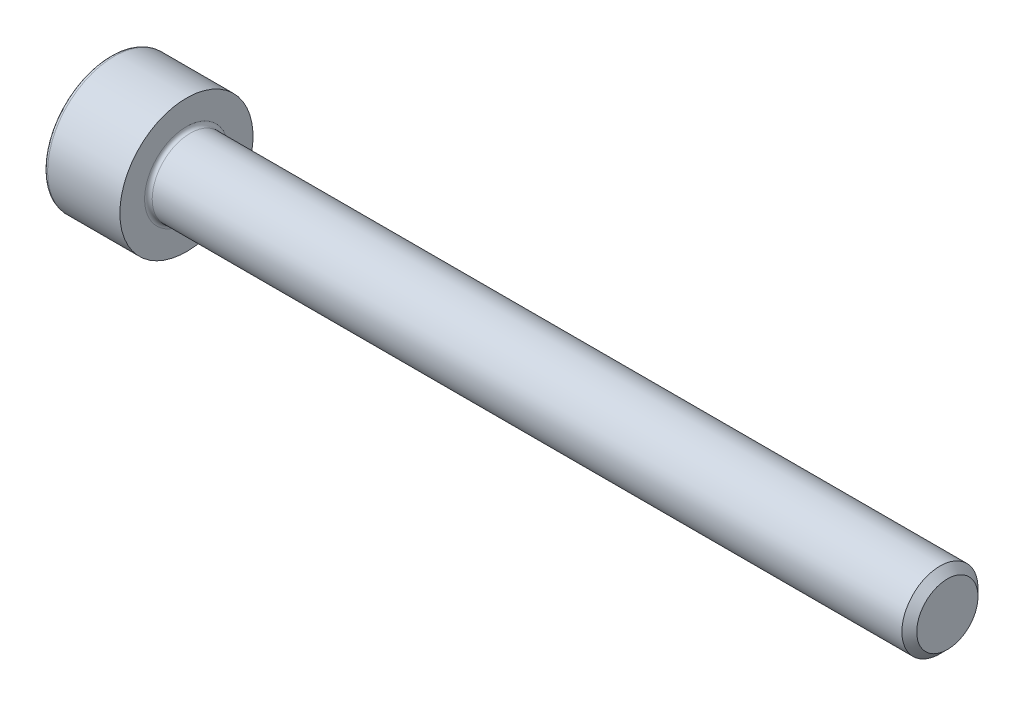
ISO-10303-21;
HEADER;
FILE_DESCRIPTION(('STEP AP214'),'2;1');
FILE_NAME('part.step','',(''),(''),'','','');
FILE_SCHEMA(('AUTOMOTIVE_DESIGN { 1 0 10303 214 1 1 1 1 }'));
ENDSEC;
DATA;
#1=APPLICATION_CONTEXT('core data for automotive mechanical design processes');
#2=APPLICATION_PROTOCOL_DEFINITION('international standard','automotive_design',2000,#1);
#3=PRODUCT_CONTEXT('',#1,'mechanical');
#4=PRODUCT('Part','Part','',(#3));
#5=PRODUCT_RELATED_PRODUCT_CATEGORY('part','',(#4));
#6=PRODUCT_DEFINITION_FORMATION('','',#4);
#7=PRODUCT_DEFINITION_CONTEXT('part definition',#1,'design');
#8=PRODUCT_DEFINITION('design','',#6,#7);
#9=PRODUCT_DEFINITION_SHAPE('','',#8);
#10=(LENGTH_UNIT() NAMED_UNIT(*) SI_UNIT(.MILLI.,.METRE.));
#11=(NAMED_UNIT(*) PLANE_ANGLE_UNIT() SI_UNIT($,.RADIAN.));
#12=(NAMED_UNIT(*) SI_UNIT($,.STERADIAN.) SOLID_ANGLE_UNIT());
#13=UNCERTAINTY_MEASURE_WITH_UNIT(LENGTH_MEASURE(1.E-05),#10,'distance_accuracy_value','');
#14=(GEOMETRIC_REPRESENTATION_CONTEXT(3) GLOBAL_UNCERTAINTY_ASSIGNED_CONTEXT((#13)) GLOBAL_UNIT_ASSIGNED_CONTEXT((#10,
#11,#12)) REPRESENTATION_CONTEXT('',''));
#15=CARTESIAN_POINT('',(0.,0.,0.));
#16=DIRECTION('',(0.,0.,1.));
#17=DIRECTION('',(1.,0.,0.));
#18=AXIS2_PLACEMENT_3D('',#15,#16,#17);
#19=CARTESIAN_POINT('',(0.,0.,0.));
#20=DIRECTION('',(-1.,0.,0.));
#21=DIRECTION('',(0.,0.,1.));
#22=AXIS2_PLACEMENT_3D('',#19,#20,#21);
#23=PLANE('',#22);
#24=DIRECTION('',(0.,-0.499999999999999,0.866025403784439));
#25=VECTOR('',#24,1.);
#26=CARTESIAN_POINT('',(0.,1.77304267668134,0.));
#27=LINE('',#26,#25);
#28=CARTESIAN_POINT('',(0.,1.77304267668134,0.));
#29=VERTEX_POINT('',#28);
#30=CARTESIAN_POINT('',(0.,0.886521338340669,1.5355));
#31=VERTEX_POINT('',#30);
#32=EDGE_CURVE('E265',#29,#31,#27,.T.);
#33=ORIENTED_EDGE('',*,*,#32,.T.);
#34=DIRECTION('',(0.,1.,0.));
#35=VECTOR('',#34,1.);
#36=CARTESIAN_POINT('',(0.,-0.886521338340671,1.5355));
#37=LINE('',#36,#35);
#38=CARTESIAN_POINT('',(0.,-0.886521338340671,1.5355));
#39=VERTEX_POINT('',#38);
#40=EDGE_CURVE('E126',#39,#31,#37,.T.);
#41=ORIENTED_EDGE('',*,*,#40,.F.);
#42=DIRECTION('',(0.,-0.500000000000001,-0.866025403784438));
#43=VECTOR('',#42,1.);
#44=CARTESIAN_POINT('',(0.,-0.886521338340671,1.5355));
#45=LINE('',#44,#43);
#46=CARTESIAN_POINT('',(0.,-1.77304267668134,0.));
#47=VERTEX_POINT('',#46);
#48=EDGE_CURVE('E268',#39,#47,#45,.T.);
#49=ORIENTED_EDGE('',*,*,#48,.T.);
#50=DIRECTION('',(0.,0.499999999999999,-0.866025403784439));
#51=VECTOR('',#50,1.);
#52=CARTESIAN_POINT('',(0.,-1.77304267668134,0.));
#53=LINE('',#52,#51);
#54=CARTESIAN_POINT('',(0.,-0.886521338340675,-1.5355));
#55=VERTEX_POINT('',#54);
#56=EDGE_CURVE('E271',#47,#55,#53,.T.);
#57=ORIENTED_EDGE('',*,*,#56,.T.);
#58=DIRECTION('',(0.,-1.,0.));
#59=VECTOR('',#58,1.);
#60=CARTESIAN_POINT('',(0.,0.886521338340665,-1.5355));
#61=LINE('',#60,#59);
#62=CARTESIAN_POINT('',(0.,0.886521338340665,-1.5355));
#63=VERTEX_POINT('',#62);
#64=EDGE_CURVE('E274',#63,#55,#61,.T.);
#65=ORIENTED_EDGE('',*,*,#64,.F.);
#66=DIRECTION('',(0.,-0.500000000000001,-0.866025403784438));
#67=VECTOR('',#66,1.);
#68=CARTESIAN_POINT('',(0.,1.77304267668134,0.));
#69=LINE('',#68,#67);
#70=EDGE_CURVE('E121',#29,#63,#69,.T.);
#71=ORIENTED_EDGE('',*,*,#70,.F.);
#72=EDGE_LOOP('',(#33,#41,#49,#57,#65,#71));
#73=FACE_BOUND('',#72,.T.);
#74=CARTESIAN_POINT('',(0.,0.,0.));
#75=DIRECTION('',(-1.,0.,0.));
#76=DIRECTION('',(0.,0.,1.));
#77=AXIS2_PLACEMENT_3D('',#74,#75,#76);
#78=CIRCLE('',#77,3.3);
#79=CARTESIAN_POINT('',(0.,0.,3.3));
#80=VERTEX_POINT('',#79);
#81=EDGE_CURVE('E42',#80,#80,#78,.T.);
#82=ORIENTED_EDGE('',*,*,#81,.T.);
#83=EDGE_LOOP('',(#82));
#84=FACE_BOUND('',#83,.T.);
#85=ADVANCED_FACE('F34',(#73,#84),#23,.T.);
#86=CARTESIAN_POINT('',(-31.75,0.,0.));
#87=DIRECTION('',(-1.,0.,0.));
#88=DIRECTION('',(0.,0.,1.));
#89=AXIS2_PLACEMENT_3D('',#86,#87,#88);
#90=CYLINDRICAL_SURFACE('',#89,3.5);
#91=CARTESIAN_POINT('',(0.199999999999999,0.,0.));
#92=DIRECTION('',(-1.,0.,0.));
#93=DIRECTION('',(0.,0.,1.));
#94=AXIS2_PLACEMENT_3D('',#91,#92,#93);
#95=CIRCLE('',#94,3.5);
#96=CARTESIAN_POINT('',(0.199999999999999,0.,3.5));
#97=VERTEX_POINT('',#96);
#98=EDGE_CURVE('E11',#97,#97,#95,.F.);
#99=ORIENTED_EDGE('',*,*,#98,.T.);
#100=EDGE_LOOP('',(#99));
#101=FACE_BOUND('',#100,.T.);
#102=CARTESIAN_POINT('',(4.,0.,0.));
#103=DIRECTION('',(-1.,0.,0.));
#104=DIRECTION('',(0.,0.,1.));
#105=AXIS2_PLACEMENT_3D('',#102,#103,#104);
#106=CIRCLE('',#105,3.5);
#107=CARTESIAN_POINT('',(4.,0.,3.5));
#108=VERTEX_POINT('',#107);
#109=EDGE_CURVE('E144',#108,#108,#106,.T.);
#110=ORIENTED_EDGE('',*,*,#109,.T.);
#111=EDGE_LOOP('',(#110));
#112=FACE_BOUND('',#111,.T.);
#113=ADVANCED_FACE('F168',(#101,#112),#90,.T.);
#114=CARTESIAN_POINT('',(4.00000000000001,3.5,0.));
#115=DIRECTION('',(1.,0.,0.));
#116=DIRECTION('',(0.,0.,-1.));
#117=AXIS2_PLACEMENT_3D('',#114,#115,#116);
#118=PLANE('',#117);
#119=CARTESIAN_POINT('',(4.00000000000001,0.,0.));
#120=DIRECTION('',(1.,0.,0.));
#121=DIRECTION('',(0.,0.,-1.));
#122=AXIS2_PLACEMENT_3D('',#119,#120,#121);
#123=CIRCLE('',#122,2.19999999999998);
#124=CARTESIAN_POINT('',(4.00000000000001,0.,-2.19999999999998));
#125=VERTEX_POINT('',#124);
#126=EDGE_CURVE('E147',#125,#125,#123,.F.);
#127=ORIENTED_EDGE('',*,*,#126,.T.);
#128=EDGE_LOOP('',(#127));
#129=FACE_BOUND('',#128,.T.);
#130=ORIENTED_EDGE('',*,*,#109,.F.);
#131=EDGE_LOOP('',(#130));
#132=FACE_BOUND('',#131,.T.);
#133=ADVANCED_FACE('F174',(#129,#132),#118,.T.);
#134=CARTESIAN_POINT('',(-31.75,0.,0.));
#135=DIRECTION('',(-1.,0.,0.));
#136=DIRECTION('',(0.,0.,1.));
#137=AXIS2_PLACEMENT_3D('',#134,#135,#136);
#138=CYLINDRICAL_SURFACE('',#137,1.99999999999998);
#139=CARTESIAN_POINT('',(4.20000000000001,0.,0.));
#140=DIRECTION('',(1.,0.,0.));
#141=DIRECTION('',(0.,0.,-1.));
#142=AXIS2_PLACEMENT_3D('',#139,#140,#141);
#143=CIRCLE('',#142,1.99999999999998);
#144=CARTESIAN_POINT('',(4.20000000000001,0.,-1.99999999999998));
#145=VERTEX_POINT('',#144);
#146=EDGE_CURVE('E150',#145,#145,#143,.T.);
#147=ORIENTED_EDGE('',*,*,#146,.T.);
#148=EDGE_LOOP('',(#147));
#149=FACE_BOUND('',#148,.T.);
#150=CARTESIAN_POINT('',(43.61,0.,0.));
#151=DIRECTION('',(-1.,0.,0.));
#152=DIRECTION('',(0.,0.,1.));
#153=AXIS2_PLACEMENT_3D('',#150,#151,#152);
#154=CIRCLE('',#153,1.99999999999995);
#155=CARTESIAN_POINT('',(43.61,0.,1.99999999999995));
#156=VERTEX_POINT('',#155);
#157=EDGE_CURVE('E141',#156,#156,#154,.T.);
#158=ORIENTED_EDGE('',*,*,#157,.T.);
#159=EDGE_LOOP('',(#158));
#160=FACE_BOUND('',#159,.T.);
#161=ADVANCED_FACE('F180',(#149,#160),#138,.T.);
#162=CARTESIAN_POINT('',(44.,0.,0.));
#163=DIRECTION('',(-1.,0.,0.));
#164=DIRECTION('',(0.,0.,1.));
#165=AXIS2_PLACEMENT_3D('',#162,#163,#164);
#166=CONICAL_SURFACE('',#165,1.61,0.785398163397327);
#167=ORIENTED_EDGE('',*,*,#157,.F.);
#168=EDGE_LOOP('',(#167));
#169=FACE_BOUND('',#168,.T.);
#170=CARTESIAN_POINT('',(44.,0.,0.));
#171=DIRECTION('',(-1.,0.,0.));
#172=DIRECTION('',(0.,0.,1.));
#173=AXIS2_PLACEMENT_3D('',#170,#171,#172);
#174=CIRCLE('',#173,1.61);
#175=CARTESIAN_POINT('',(44.,0.,1.61));
#176=VERTEX_POINT('',#175);
#177=EDGE_CURVE('E137',#176,#176,#174,.T.);
#178=ORIENTED_EDGE('',*,*,#177,.T.);
#179=EDGE_LOOP('',(#178));
#180=FACE_BOUND('',#179,.T.);
#181=ADVANCED_FACE('F184',(#169,#180),#166,.T.);
#182=CARTESIAN_POINT('',(44.,1.61,0.));
#183=DIRECTION('',(1.,0.,0.));
#184=DIRECTION('',(0.,0.,-1.));
#185=AXIS2_PLACEMENT_3D('',#182,#183,#184);
#186=PLANE('',#185);
#187=ORIENTED_EDGE('',*,*,#177,.F.);
#188=EDGE_LOOP('',(#187));
#189=FACE_BOUND('',#188,.T.);
#190=ADVANCED_FACE('F164',(#189),#186,.T.);
#191=CARTESIAN_POINT('',(4.20000000000001,0.,0.));
#192=DIRECTION('',(1.,0.,0.));
#193=DIRECTION('',(0.,0.,-1.));
#194=AXIS2_PLACEMENT_3D('',#191,#192,#193);
#195=TOROIDAL_SURFACE('',#194,2.19999999999998,0.2);
#196=ORIENTED_EDGE('',*,*,#146,.F.);
#197=EDGE_LOOP('',(#196));
#198=FACE_BOUND('',#197,.T.);
#199=ORIENTED_EDGE('',*,*,#126,.F.);
#200=EDGE_LOOP('',(#199));
#201=FACE_BOUND('',#200,.T.);
#202=ADVANCED_FACE('F157',(#198,#201),#195,.F.);
#203=CARTESIAN_POINT('',(0.199999999999999,0.,0.));
#204=DIRECTION('',(-1.,0.,0.));
#205=DIRECTION('',(0.,0.,1.));
#206=AXIS2_PLACEMENT_3D('',#203,#204,#205);
#207=TOROIDAL_SURFACE('',#206,3.3,0.2);
#208=ORIENTED_EDGE('',*,*,#98,.F.);
#209=EDGE_LOOP('',(#208));
#210=FACE_BOUND('',#209,.T.);
#211=ORIENTED_EDGE('',*,*,#81,.F.);
#212=EDGE_LOOP('',(#211));
#213=FACE_BOUND('',#212,.T.);
#214=ADVANCED_FACE('F36',(#210,#213),#207,.T.);
#215=CARTESIAN_POINT('',(2.,1.77304267668134,0.));
#216=DIRECTION('',(0.,-0.866025403784439,-0.499999999999999));
#217=DIRECTION('',(0.,0.499999999999999,-0.866025403784439));
#218=AXIS2_PLACEMENT_3D('',#215,#216,#217);
#219=PLANE('',#218);
#220=ORIENTED_EDGE('',*,*,#32,.F.);
#221=DIRECTION('',(-1.,0.,0.));
#222=VECTOR('',#221,1.);
#223=CARTESIAN_POINT('',(2.,1.77304267668134,0.));
#224=LINE('',#223,#222);
#225=CARTESIAN_POINT('',(2.,1.77304267668134,0.));
#226=VERTEX_POINT('',#225);
#227=EDGE_CURVE('E264',#226,#29,#224,.T.);
#228=ORIENTED_EDGE('',*,*,#227,.F.);
#229=DIRECTION('',(0.,-0.499999999999999,0.866025403784439));
#230=VECTOR('',#229,1.);
#231=CARTESIAN_POINT('',(2.,1.77304267668134,0.));
#232=LINE('',#231,#230);
#233=CARTESIAN_POINT('',(2.,1.32978200751101,0.767749999999998));
#234=VERTEX_POINT('',#233);
#235=EDGE_CURVE('E49',#226,#234,#232,.T.);
#236=ORIENTED_EDGE('',*,*,#235,.T.);
#237=CARTESIAN_POINT('',(2.,0.886521338340669,1.5355));
#238=VERTEX_POINT('',#237);
#239=EDGE_CURVE('E107',#234,#238,#232,.T.);
#240=ORIENTED_EDGE('',*,*,#239,.T.);
#241=DIRECTION('',(-1.,0.,0.));
#242=VECTOR('',#241,1.);
#243=CARTESIAN_POINT('',(2.,0.886521338340669,1.5355));
#244=LINE('',#243,#242);
#245=EDGE_CURVE('E119',#238,#31,#244,.T.);
#246=ORIENTED_EDGE('',*,*,#245,.T.);
#247=EDGE_LOOP('',(#220,#228,#236,#240,#246));
#248=FACE_BOUND('',#247,.T.);
#249=ADVANCED_FACE('F118',(#248),#219,.T.);
#250=CARTESIAN_POINT('',(2.,-0.886521338340671,1.5355));
#251=DIRECTION('',(0.,0.,1.));
#252=DIRECTION('',(0.,-1.,0.));
#253=AXIS2_PLACEMENT_3D('',#250,#251,#252);
#254=PLANE('',#253);
#255=ORIENTED_EDGE('',*,*,#40,.T.);
#256=ORIENTED_EDGE('',*,*,#245,.F.);
#257=DIRECTION('',(0.,1.,0.));
#258=VECTOR('',#257,1.);
#259=CARTESIAN_POINT('',(2.,-0.886521338340671,1.5355));
#260=LINE('',#259,#258);
#261=CARTESIAN_POINT('',(2.,0.,1.5355));
#262=VERTEX_POINT('',#261);
#263=EDGE_CURVE('E105',#262,#238,#260,.T.);
#264=ORIENTED_EDGE('',*,*,#263,.F.);
#265=CARTESIAN_POINT('',(2.,-0.886521338340671,1.5355));
#266=VERTEX_POINT('',#265);
#267=EDGE_CURVE('E115',#266,#262,#260,.T.);
#268=ORIENTED_EDGE('',*,*,#267,.F.);
#269=DIRECTION('',(-1.,0.,0.));
#270=VECTOR('',#269,1.);
#271=CARTESIAN_POINT('',(2.,-0.886521338340671,1.5355));
#272=LINE('',#271,#270);
#273=EDGE_CURVE('E128',#266,#39,#272,.T.);
#274=ORIENTED_EDGE('',*,*,#273,.T.);
#275=EDGE_LOOP('',(#255,#256,#264,#268,#274));
#276=FACE_BOUND('',#275,.T.);
#277=ADVANCED_FACE('F123',(#276),#254,.F.);
#278=CARTESIAN_POINT('',(2.,-0.886521338340671,1.5355));
#279=DIRECTION('',(0.,0.866025403784438,-0.500000000000001));
#280=DIRECTION('',(0.,0.500000000000001,0.866025403784438));
#281=AXIS2_PLACEMENT_3D('',#278,#279,#280);
#282=PLANE('',#281);
#283=ORIENTED_EDGE('',*,*,#48,.F.);
#284=ORIENTED_EDGE('',*,*,#273,.F.);
#285=DIRECTION('',(0.,-0.500000000000001,-0.866025403784438));
#286=VECTOR('',#285,1.);
#287=CARTESIAN_POINT('',(2.,-0.886521338340671,1.5355));
#288=LINE('',#287,#286);
#289=CARTESIAN_POINT('',(2.,-1.329782007511,0.767750000000002));
#290=VERTEX_POINT('',#289);
#291=EDGE_CURVE('E245',#266,#290,#288,.T.);
#292=ORIENTED_EDGE('',*,*,#291,.T.);
#293=CARTESIAN_POINT('',(2.,-1.77304267668134,0.));
#294=VERTEX_POINT('',#293);
#295=EDGE_CURVE('E247',#290,#294,#288,.T.);
#296=ORIENTED_EDGE('',*,*,#295,.T.);
#297=DIRECTION('',(-1.,0.,0.));
#298=VECTOR('',#297,1.);
#299=CARTESIAN_POINT('',(2.,-1.77304267668134,0.));
#300=LINE('',#299,#298);
#301=EDGE_CURVE('E133',#294,#47,#300,.T.);
#302=ORIENTED_EDGE('',*,*,#301,.T.);
#303=EDGE_LOOP('',(#283,#284,#292,#296,#302));
#304=FACE_BOUND('',#303,.T.);
#305=ADVANCED_FACE('F197',(#304),#282,.T.);
#306=CARTESIAN_POINT('',(2.,-1.77304267668134,0.));
#307=DIRECTION('',(0.,0.866025403784439,0.499999999999999));
#308=DIRECTION('',(0.,-0.499999999999999,0.866025403784439));
#309=AXIS2_PLACEMENT_3D('',#306,#307,#308);
#310=PLANE('',#309);
#311=ORIENTED_EDGE('',*,*,#56,.F.);
#312=ORIENTED_EDGE('',*,*,#301,.F.);
#313=DIRECTION('',(0.,0.499999999999999,-0.866025403784439));
#314=VECTOR('',#313,1.);
#315=CARTESIAN_POINT('',(2.,-1.77304267668134,0.));
#316=LINE('',#315,#314);
#317=CARTESIAN_POINT('',(2.,-1.32978200751101,-0.76775));
#318=VERTEX_POINT('',#317);
#319=EDGE_CURVE('E250',#294,#318,#316,.T.);
#320=ORIENTED_EDGE('',*,*,#319,.T.);
#321=CARTESIAN_POINT('',(2.,-0.886521338340675,-1.5355));
#322=VERTEX_POINT('',#321);
#323=EDGE_CURVE('E254',#318,#322,#316,.T.);
#324=ORIENTED_EDGE('',*,*,#323,.T.);
#325=DIRECTION('',(-1.,0.,0.));
#326=VECTOR('',#325,1.);
#327=CARTESIAN_POINT('',(2.,-0.886521338340675,-1.5355));
#328=LINE('',#327,#326);
#329=EDGE_CURVE('E283',#322,#55,#328,.T.);
#330=ORIENTED_EDGE('',*,*,#329,.T.);
#331=EDGE_LOOP('',(#311,#312,#320,#324,#330));
#332=FACE_BOUND('',#331,.T.);
#333=ADVANCED_FACE('F200',(#332),#310,.T.);
#334=CARTESIAN_POINT('',(2.,0.886521338340665,-1.5355));
#335=DIRECTION('',(0.,0.,-1.));
#336=DIRECTION('',(0.,1.,0.));
#337=AXIS2_PLACEMENT_3D('',#334,#335,#336);
#338=PLANE('',#337);
#339=ORIENTED_EDGE('',*,*,#64,.T.);
#340=ORIENTED_EDGE('',*,*,#329,.F.);
#341=DIRECTION('',(0.,-1.,0.));
#342=VECTOR('',#341,1.);
#343=CARTESIAN_POINT('',(2.,0.886521338340665,-1.5355));
#344=LINE('',#343,#342);
#345=CARTESIAN_POINT('',(2.,0.,-1.5355));
#346=VERTEX_POINT('',#345);
#347=EDGE_CURVE('E258',#346,#322,#344,.T.);
#348=ORIENTED_EDGE('',*,*,#347,.F.);
#349=CARTESIAN_POINT('',(2.,0.886521338340665,-1.5355));
#350=VERTEX_POINT('',#349);
#351=EDGE_CURVE('E259',#350,#346,#344,.T.);
#352=ORIENTED_EDGE('',*,*,#351,.F.);
#353=DIRECTION('',(-1.,0.,0.));
#354=VECTOR('',#353,1.);
#355=CARTESIAN_POINT('',(2.,0.886521338340665,-1.5355));
#356=LINE('',#355,#354);
#357=EDGE_CURVE('E280',#350,#63,#356,.T.);
#358=ORIENTED_EDGE('',*,*,#357,.T.);
#359=EDGE_LOOP('',(#339,#340,#348,#352,#358));
#360=FACE_BOUND('',#359,.T.);
#361=ADVANCED_FACE('F204',(#360),#338,.F.);
#362=CARTESIAN_POINT('',(2.,1.77304267668134,0.));
#363=DIRECTION('',(0.,0.866025403784438,-0.500000000000001));
#364=DIRECTION('',(0.,0.500000000000001,0.866025403784438));
#365=AXIS2_PLACEMENT_3D('',#362,#363,#364);
#366=PLANE('',#365);
#367=ORIENTED_EDGE('',*,*,#70,.T.);
#368=ORIENTED_EDGE('',*,*,#357,.F.);
#369=DIRECTION('',(0.,-0.500000000000001,-0.866025403784438));
#370=VECTOR('',#369,1.);
#371=CARTESIAN_POINT('',(2.,1.77304267668134,0.));
#372=LINE('',#371,#370);
#373=CARTESIAN_POINT('',(2.,1.329782007511,-0.767750000000001));
#374=VERTEX_POINT('',#373);
#375=EDGE_CURVE('E262',#374,#350,#372,.T.);
#376=ORIENTED_EDGE('',*,*,#375,.F.);
#377=EDGE_CURVE('E236',#226,#374,#372,.T.);
#378=ORIENTED_EDGE('',*,*,#377,.F.);
#379=ORIENTED_EDGE('',*,*,#227,.T.);
#380=EDGE_LOOP('',(#367,#368,#376,#378,#379));
#381=FACE_BOUND('',#380,.T.);
#382=ADVANCED_FACE('F208',(#381),#366,.F.);
#383=CARTESIAN_POINT('',(2.,0.88652133834067,1.5355));
#384=DIRECTION('',(-1.,0.,0.));
#385=DIRECTION('',(0.,0.,1.));
#386=AXIS2_PLACEMENT_3D('',#383,#384,#385);
#387=PLANE('',#386);
#388=CARTESIAN_POINT('',(2.,0.,0.));
#389=DIRECTION('',(-1.,0.,0.));
#390=DIRECTION('',(0.,0.,1.));
#391=AXIS2_PLACEMENT_3D('',#388,#389,#390);
#392=CIRCLE('',#391,1.5355);
#393=EDGE_CURVE('E127',#290,#262,#392,.T.);
#394=ORIENTED_EDGE('',*,*,#393,.F.);
#395=ORIENTED_EDGE('',*,*,#291,.F.);
#396=ORIENTED_EDGE('',*,*,#267,.T.);
#397=EDGE_LOOP('',(#394,#395,#396));
#398=FACE_BOUND('',#397,.T.);
#399=ADVANCED_FACE('F212',(#398),#387,.T.);
#400=EDGE_CURVE('E131',#318,#290,#392,.T.);
#401=ORIENTED_EDGE('',*,*,#400,.F.);
#402=ORIENTED_EDGE('',*,*,#319,.F.);
#403=ORIENTED_EDGE('',*,*,#295,.F.);
#404=EDGE_LOOP('',(#401,#402,#403));
#405=FACE_BOUND('',#404,.T.);
#406=ADVANCED_FACE('F215',(#405),#387,.T.);
#407=EDGE_CURVE('E289',#346,#318,#392,.T.);
#408=ORIENTED_EDGE('',*,*,#407,.F.);
#409=ORIENTED_EDGE('',*,*,#347,.T.);
#410=ORIENTED_EDGE('',*,*,#323,.F.);
#411=EDGE_LOOP('',(#408,#409,#410));
#412=FACE_BOUND('',#411,.T.);
#413=ADVANCED_FACE('F220',(#412),#387,.T.);
#414=EDGE_CURVE('E239',#374,#346,#392,.T.);
#415=ORIENTED_EDGE('',*,*,#414,.F.);
#416=ORIENTED_EDGE('',*,*,#375,.T.);
#417=ORIENTED_EDGE('',*,*,#351,.T.);
#418=EDGE_LOOP('',(#415,#416,#417));
#419=FACE_BOUND('',#418,.T.);
#420=ADVANCED_FACE('F227',(#419),#387,.T.);
#421=EDGE_CURVE('E138',#234,#374,#392,.T.);
#422=ORIENTED_EDGE('',*,*,#421,.F.);
#423=ORIENTED_EDGE('',*,*,#235,.F.);
#424=ORIENTED_EDGE('',*,*,#377,.T.);
#425=EDGE_LOOP('',(#422,#423,#424));
#426=FACE_BOUND('',#425,.T.);
#427=ADVANCED_FACE('F223',(#426),#387,.T.);
#428=EDGE_CURVE('E110',#262,#234,#392,.T.);
#429=ORIENTED_EDGE('',*,*,#428,.F.);
#430=ORIENTED_EDGE('',*,*,#263,.T.);
#431=ORIENTED_EDGE('',*,*,#239,.F.);
#432=EDGE_LOOP('',(#429,#430,#431));
#433=FACE_BOUND('',#432,.T.);
#434=ADVANCED_FACE('F106',(#433),#387,.T.);
#435=CARTESIAN_POINT('',(2.,0.,0.));
#436=DIRECTION('',(-1.,0.,0.));
#437=DIRECTION('',(0.,0.,1.));
#438=AXIS2_PLACEMENT_3D('',#435,#436,#437);
#439=CONICAL_SURFACE('',#438,1.5355,1.04719755119659);
#440=CARTESIAN_POINT('',(2.88652133834068,0.,0.));
#441=VERTEX_POINT('',#440);
#442=VERTEX_LOOP('',#441);
#443=FACE_BOUND('',#442,.T.);
#444=ORIENTED_EDGE('',*,*,#428,.T.);
#445=ORIENTED_EDGE('',*,*,#421,.T.);
#446=ORIENTED_EDGE('',*,*,#414,.T.);
#447=ORIENTED_EDGE('',*,*,#407,.T.);
#448=ORIENTED_EDGE('',*,*,#400,.T.);
#449=ORIENTED_EDGE('',*,*,#393,.T.);
#450=EDGE_LOOP('',(#444,#445,#446,#447,#448,#449));
#451=FACE_BOUND('',#450,.T.);
#452=ADVANCED_FACE('F192',(#443,#451),#439,.F.);
#453=CLOSED_SHELL('',(#85,#113,#133,#161,#181,#190,#202,#214,#249,#277,#305,#333,#361,#382,#399,
#406,#413,#420,#427,#434,#452));
#454=MANIFOLD_SOLID_BREP('B2',#453);
#455=ADVANCED_BREP_SHAPE_REPRESENTATION('',(#18,#454),#14);
#456=SHAPE_DEFINITION_REPRESENTATION(#9,#455);
ENDSEC;
END-ISO-10303-21;
